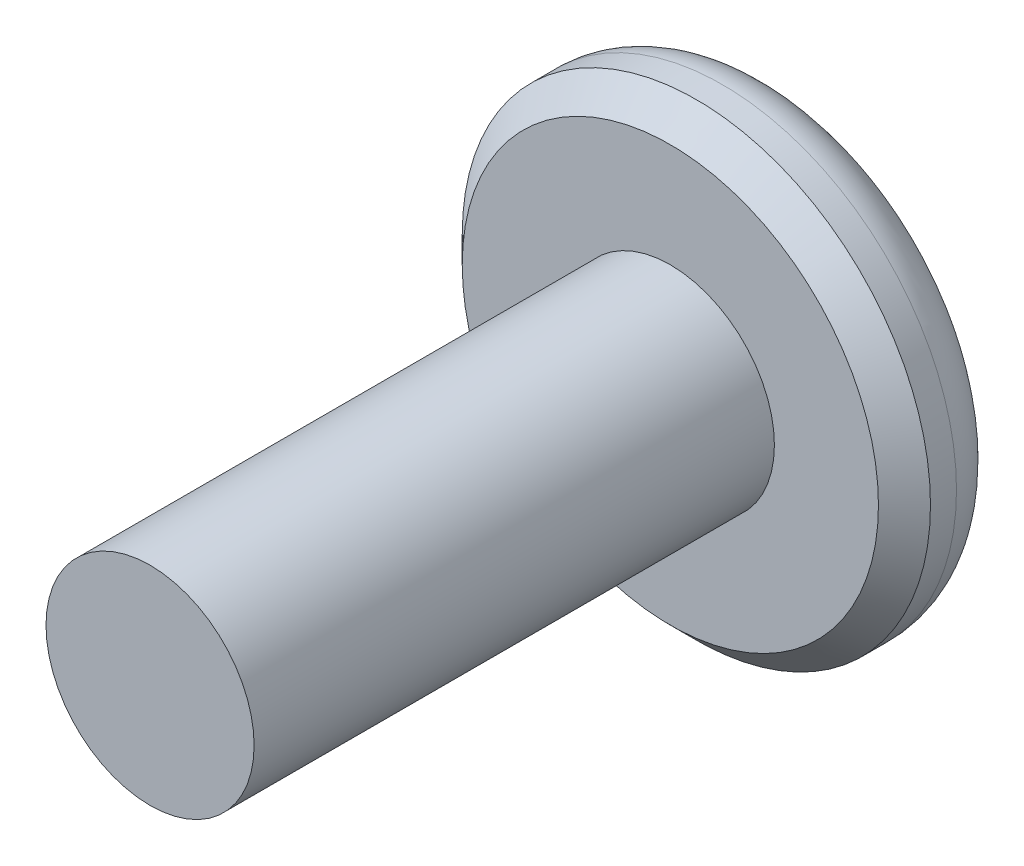
ISO-10303-21;
HEADER;
FILE_DESCRIPTION(('STEP AP214'),'2;1');
FILE_NAME('part.step','',(''),(''),'','','');
FILE_SCHEMA(('AUTOMOTIVE_DESIGN { 1 0 10303 214 1 1 1 1 }'));
ENDSEC;
DATA;
#1=APPLICATION_CONTEXT('core data for automotive mechanical design processes');
#2=APPLICATION_PROTOCOL_DEFINITION('international standard','automotive_design',2000,#1);
#3=PRODUCT_CONTEXT('',#1,'mechanical');
#4=PRODUCT('Part','Part','',(#3));
#5=PRODUCT_RELATED_PRODUCT_CATEGORY('part','',(#4));
#6=PRODUCT_DEFINITION_FORMATION('','',#4);
#7=PRODUCT_DEFINITION_CONTEXT('part definition',#1,'design');
#8=PRODUCT_DEFINITION('design','',#6,#7);
#9=PRODUCT_DEFINITION_SHAPE('','',#8);
#10=(LENGTH_UNIT() NAMED_UNIT(*) SI_UNIT(.MILLI.,.METRE.));
#11=(NAMED_UNIT(*) PLANE_ANGLE_UNIT() SI_UNIT($,.RADIAN.));
#12=(NAMED_UNIT(*) SI_UNIT($,.STERADIAN.) SOLID_ANGLE_UNIT());
#13=UNCERTAINTY_MEASURE_WITH_UNIT(LENGTH_MEASURE(1.E-05),#10,'distance_accuracy_value','');
#14=(GEOMETRIC_REPRESENTATION_CONTEXT(3) GLOBAL_UNCERTAINTY_ASSIGNED_CONTEXT((#13)) GLOBAL_UNIT_ASSIGNED_CONTEXT((#10,
#11,#12)) REPRESENTATION_CONTEXT('',''));
#15=CARTESIAN_POINT('',(0.,0.,0.));
#16=DIRECTION('',(0.,0.,1.));
#17=DIRECTION('',(1.,0.,0.));
#18=AXIS2_PLACEMENT_3D('',#15,#16,#17);
#19=CARTESIAN_POINT('',(0.,0.,2.));
#20=DIRECTION('',(0.,0.,-1.));
#21=DIRECTION('',(-1.,0.,0.));
#22=AXIS2_PLACEMENT_3D('',#19,#20,#21);
#23=CYLINDRICAL_SURFACE('',#22,4.5);
#24=CARTESIAN_POINT('',(0.,0.,1.5));
#25=DIRECTION('',(0.,0.,1.));
#26=DIRECTION('',(1.,0.,0.));
#27=AXIS2_PLACEMENT_3D('',#24,#25,#26);
#28=CIRCLE('',#27,4.5);
#29=CARTESIAN_POINT('',(4.5,0.,1.5));
#30=VERTEX_POINT('',#29);
#31=EDGE_CURVE('E11',#30,#30,#28,.F.);
#32=ORIENTED_EDGE('',*,*,#31,.T.);
#33=EDGE_LOOP('',(#32));
#34=FACE_BOUND('',#33,.T.);
#35=CARTESIAN_POINT('',(0.,0.,1.));
#36=DIRECTION('',(0.,0.,1.));
#37=DIRECTION('',(1.,0.,0.));
#38=AXIS2_PLACEMENT_3D('',#35,#36,#37);
#39=CIRCLE('',#38,4.5);
#40=CARTESIAN_POINT('',(4.5,0.,1.));
#41=VERTEX_POINT('',#40);
#42=EDGE_CURVE('E151',#41,#41,#39,.T.);
#43=ORIENTED_EDGE('',*,*,#42,.T.);
#44=EDGE_LOOP('',(#43));
#45=FACE_BOUND('',#44,.T.);
#46=ADVANCED_FACE('F37',(#34,#45),#23,.T.);
#47=CARTESIAN_POINT('',(0.,0.,2.));
#48=DIRECTION('',(0.,0.,1.));
#49=DIRECTION('',(1.,0.,0.));
#50=AXIS2_PLACEMENT_3D('',#47,#48,#49);
#51=PLANE('',#50);
#52=CARTESIAN_POINT('',(0.,0.,2.));
#53=DIRECTION('',(0.,0.,1.));
#54=DIRECTION('',(1.,0.,0.));
#55=AXIS2_PLACEMENT_3D('',#52,#53,#54);
#56=CIRCLE('',#55,4.);
#57=CARTESIAN_POINT('',(4.,0.,2.));
#58=VERTEX_POINT('',#57);
#59=EDGE_CURVE('E46',#58,#58,#56,.T.);
#60=ORIENTED_EDGE('',*,*,#59,.T.);
#61=EDGE_LOOP('',(#60));
#62=FACE_BOUND('',#61,.T.);
#63=CARTESIAN_POINT('',(0.,0.,2.));
#64=DIRECTION('',(0.,0.,1.));
#65=DIRECTION('',(1.,0.,0.));
#66=AXIS2_PLACEMENT_3D('',#63,#64,#65);
#67=CIRCLE('',#66,2.);
#68=CARTESIAN_POINT('',(2.,0.,2.));
#69=VERTEX_POINT('',#68);
#70=EDGE_CURVE('E148',#69,#69,#67,.T.);
#71=ORIENTED_EDGE('',*,*,#70,.F.);
#72=EDGE_LOOP('',(#71));
#73=FACE_BOUND('',#72,.T.);
#74=ADVANCED_FACE('F159',(#62,#73),#51,.T.);
#75=CARTESIAN_POINT('',(0.,0.,0.));
#76=DIRECTION('',(0.,0.,1.));
#77=DIRECTION('',(1.,0.,0.));
#78=AXIS2_PLACEMENT_3D('',#75,#76,#77);
#79=PLANE('',#78);
#80=DIRECTION('',(0.5,-0.866025403784439,0.));
#81=VECTOR('',#80,1.);
#82=CARTESIAN_POINT('',(0.866025403784439,1.5,0.));
#83=LINE('',#82,#81);
#84=CARTESIAN_POINT('',(0.866025403784439,1.5,0.));
#85=VERTEX_POINT('',#84);
#86=CARTESIAN_POINT('',(1.73205080756888,0.,0.));
#87=VERTEX_POINT('',#86);
#88=EDGE_CURVE('E127',#85,#87,#83,.T.);
#89=ORIENTED_EDGE('',*,*,#88,.F.);
#90=DIRECTION('',(1.,0.,0.));
#91=VECTOR('',#90,1.);
#92=CARTESIAN_POINT('',(-0.866025403784438,1.5,0.));
#93=LINE('',#92,#91);
#94=CARTESIAN_POINT('',(-0.866025403784438,1.5,0.));
#95=VERTEX_POINT('',#94);
#96=EDGE_CURVE('E53',#95,#85,#93,.T.);
#97=ORIENTED_EDGE('',*,*,#96,.F.);
#98=DIRECTION('',(0.5,0.866025403784438,0.));
#99=VECTOR('',#98,1.);
#100=CARTESIAN_POINT('',(-1.73205080756888,0.,0.));
#101=LINE('',#100,#99);
#102=CARTESIAN_POINT('',(-1.73205080756888,0.,0.));
#103=VERTEX_POINT('',#102);
#104=EDGE_CURVE('E136',#103,#95,#101,.T.);
#105=ORIENTED_EDGE('',*,*,#104,.F.);
#106=DIRECTION('',(-0.5,0.866025403784439,0.));
#107=VECTOR('',#106,1.);
#108=CARTESIAN_POINT('',(-0.866025403784437,-1.5,0.));
#109=LINE('',#108,#107);
#110=CARTESIAN_POINT('',(-0.866025403784437,-1.5,0.));
#111=VERTEX_POINT('',#110);
#112=EDGE_CURVE('E134',#111,#103,#109,.T.);
#113=ORIENTED_EDGE('',*,*,#112,.F.);
#114=DIRECTION('',(-1.,0.,0.));
#115=VECTOR('',#114,1.);
#116=CARTESIAN_POINT('',(0.866025403784438,-1.5,0.));
#117=LINE('',#116,#115);
#118=CARTESIAN_POINT('',(0.866025403784438,-1.5,0.));
#119=VERTEX_POINT('',#118);
#120=EDGE_CURVE('E101',#119,#111,#117,.T.);
#121=ORIENTED_EDGE('',*,*,#120,.F.);
#122=DIRECTION('',(-0.5,-0.866025403784439,0.));
#123=VECTOR('',#122,1.);
#124=CARTESIAN_POINT('',(1.73205080756888,0.,0.));
#125=LINE('',#124,#123);
#126=EDGE_CURVE('E130',#87,#119,#125,.T.);
#127=ORIENTED_EDGE('',*,*,#126,.F.);
#128=EDGE_LOOP('',(#89,#97,#105,#113,#121,#127));
#129=FACE_BOUND('',#128,.T.);
#130=CARTESIAN_POINT('',(0.,0.,0.));
#131=DIRECTION('',(0.,0.,1.));
#132=DIRECTION('',(1.,0.,0.));
#133=AXIS2_PLACEMENT_3D('',#130,#131,#132);
#134=CIRCLE('',#133,3.5);
#135=CARTESIAN_POINT('',(3.5,0.,0.));
#136=VERTEX_POINT('',#135);
#137=EDGE_CURVE('E154',#136,#136,#134,.F.);
#138=ORIENTED_EDGE('',*,*,#137,.T.);
#139=EDGE_LOOP('',(#138));
#140=FACE_BOUND('',#139,.T.);
#141=ADVANCED_FACE('F181',(#129,#140),#79,.F.);
#142=CARTESIAN_POINT('',(0.,0.,12.));
#143=DIRECTION('',(0.,0.,-1.));
#144=DIRECTION('',(-1.,0.,0.));
#145=AXIS2_PLACEMENT_3D('',#142,#143,#144);
#146=CYLINDRICAL_SURFACE('',#145,2.);
#147=CARTESIAN_POINT('',(0.,0.,12.));
#148=DIRECTION('',(0.,0.,1.));
#149=DIRECTION('',(1.,0.,0.));
#150=AXIS2_PLACEMENT_3D('',#147,#148,#149);
#151=CIRCLE('',#150,2.);
#152=CARTESIAN_POINT('',(2.,0.,12.));
#153=VERTEX_POINT('',#152);
#154=EDGE_CURVE('E140',#153,#153,#151,.T.);
#155=ORIENTED_EDGE('',*,*,#154,.F.);
#156=EDGE_LOOP('',(#155));
#157=FACE_BOUND('',#156,.T.);
#158=ORIENTED_EDGE('',*,*,#70,.T.);
#159=EDGE_LOOP('',(#158));
#160=FACE_BOUND('',#159,.T.);
#161=ADVANCED_FACE('F186',(#157,#160),#146,.T.);
#162=CARTESIAN_POINT('',(0.,0.,12.));
#163=DIRECTION('',(0.,0.,1.));
#164=DIRECTION('',(1.,0.,0.));
#165=AXIS2_PLACEMENT_3D('',#162,#163,#164);
#166=PLANE('',#165);
#167=ORIENTED_EDGE('',*,*,#154,.T.);
#168=EDGE_LOOP('',(#167));
#169=FACE_BOUND('',#168,.T.);
#170=ADVANCED_FACE('F172',(#169),#166,.T.);
#171=CARTESIAN_POINT('',(0.,0.,1.));
#172=DIRECTION('',(0.,0.,1.));
#173=DIRECTION('',(1.,0.,0.));
#174=AXIS2_PLACEMENT_3D('',#171,#172,#173);
#175=TOROIDAL_SURFACE('',#174,3.5,1.);
#176=ORIENTED_EDGE('',*,*,#137,.F.);
#177=EDGE_LOOP('',(#176));
#178=FACE_BOUND('',#177,.T.);
#179=ORIENTED_EDGE('',*,*,#42,.F.);
#180=EDGE_LOOP('',(#179));
#181=FACE_BOUND('',#180,.T.);
#182=ADVANCED_FACE('F164',(#178,#181),#175,.T.);
#183=CARTESIAN_POINT('',(0.,0.,2.));
#184=DIRECTION('',(0.,0.,-1.));
#185=DIRECTION('',(-1.,0.,0.));
#186=AXIS2_PLACEMENT_3D('',#183,#184,#185);
#187=CONICAL_SURFACE('',#186,4.,0.785398163397447);
#188=ORIENTED_EDGE('',*,*,#31,.F.);
#189=EDGE_LOOP('',(#188));
#190=FACE_BOUND('',#189,.T.);
#191=ORIENTED_EDGE('',*,*,#59,.F.);
#192=EDGE_LOOP('',(#191));
#193=FACE_BOUND('',#192,.T.);
#194=ADVANCED_FACE('F40',(#190,#193),#187,.T.);
#195=CARTESIAN_POINT('',(-0.866025403784438,1.5,1.));
#196=DIRECTION('',(0.,1.,0.));
#197=DIRECTION('',(0.,0.,1.));
#198=AXIS2_PLACEMENT_3D('',#195,#196,#197);
#199=PLANE('',#198);
#200=ORIENTED_EDGE('',*,*,#96,.T.);
#201=DIRECTION('',(0.,0.,-1.));
#202=VECTOR('',#201,1.);
#203=CARTESIAN_POINT('',(0.866025403784439,1.5,1.));
#204=LINE('',#203,#202);
#205=CARTESIAN_POINT('',(0.866025403784439,1.5,1.));
#206=VERTEX_POINT('',#205);
#207=EDGE_CURVE('E83',#206,#85,#204,.T.);
#208=ORIENTED_EDGE('',*,*,#207,.F.);
#209=DIRECTION('',(1.,0.,0.));
#210=VECTOR('',#209,1.);
#211=CARTESIAN_POINT('',(-0.866025403784438,1.5,1.));
#212=LINE('',#211,#210);
#213=CARTESIAN_POINT('',(-0.866025403784438,1.5,1.));
#214=VERTEX_POINT('',#213);
#215=EDGE_CURVE('E138',#214,#206,#212,.T.);
#216=ORIENTED_EDGE('',*,*,#215,.F.);
#217=DIRECTION('',(0.,0.,-1.));
#218=VECTOR('',#217,1.);
#219=CARTESIAN_POINT('',(-0.866025403784438,1.5,1.));
#220=LINE('',#219,#218);
#221=EDGE_CURVE('E61',#214,#95,#220,.T.);
#222=ORIENTED_EDGE('',*,*,#221,.T.);
#223=EDGE_LOOP('',(#200,#208,#216,#222));
#224=FACE_BOUND('',#223,.T.);
#225=ADVANCED_FACE('F163',(#224),#199,.F.);
#226=CARTESIAN_POINT('',(-1.73205080756888,0.,1.));
#227=DIRECTION('',(-0.866025403784439,0.5,0.));
#228=DIRECTION('',(-0.5,-0.866025403784439,0.));
#229=AXIS2_PLACEMENT_3D('',#226,#227,#228);
#230=PLANE('',#229);
#231=ORIENTED_EDGE('',*,*,#104,.T.);
#232=ORIENTED_EDGE('',*,*,#221,.F.);
#233=DIRECTION('',(0.5,0.866025403784438,0.));
#234=VECTOR('',#233,1.);
#235=CARTESIAN_POINT('',(-1.73205080756888,0.,1.));
#236=LINE('',#235,#234);
#237=CARTESIAN_POINT('',(-1.73205080756888,0.,1.));
#238=VERTEX_POINT('',#237);
#239=EDGE_CURVE('E113',#238,#214,#236,.T.);
#240=ORIENTED_EDGE('',*,*,#239,.F.);
#241=DIRECTION('',(0.,0.,-1.));
#242=VECTOR('',#241,1.);
#243=CARTESIAN_POINT('',(-1.73205080756888,0.,1.));
#244=LINE('',#243,#242);
#245=EDGE_CURVE('E105',#238,#103,#244,.T.);
#246=ORIENTED_EDGE('',*,*,#245,.T.);
#247=EDGE_LOOP('',(#231,#232,#240,#246));
#248=FACE_BOUND('',#247,.T.);
#249=ADVANCED_FACE('F170',(#248),#230,.F.);
#250=CARTESIAN_POINT('',(-0.866025403784437,-1.5,1.));
#251=DIRECTION('',(-0.866025403784439,-0.5,0.));
#252=DIRECTION('',(0.5,-0.866025403784439,0.));
#253=AXIS2_PLACEMENT_3D('',#250,#251,#252);
#254=PLANE('',#253);
#255=ORIENTED_EDGE('',*,*,#112,.T.);
#256=ORIENTED_EDGE('',*,*,#245,.F.);
#257=DIRECTION('',(-0.5,0.866025403784439,0.));
#258=VECTOR('',#257,1.);
#259=CARTESIAN_POINT('',(-0.866025403784437,-1.5,1.));
#260=LINE('',#259,#258);
#261=CARTESIAN_POINT('',(-0.866025403784437,-1.5,1.));
#262=VERTEX_POINT('',#261);
#263=EDGE_CURVE('E109',#262,#238,#260,.T.);
#264=ORIENTED_EDGE('',*,*,#263,.F.);
#265=DIRECTION('',(0.,0.,-1.));
#266=VECTOR('',#265,1.);
#267=CARTESIAN_POINT('',(-0.866025403784437,-1.5,1.));
#268=LINE('',#267,#266);
#269=EDGE_CURVE('E94',#262,#111,#268,.T.);
#270=ORIENTED_EDGE('',*,*,#269,.T.);
#271=EDGE_LOOP('',(#255,#256,#264,#270));
#272=FACE_BOUND('',#271,.T.);
#273=ADVANCED_FACE('F110',(#272),#254,.F.);
#274=CARTESIAN_POINT('',(0.866025403784438,-1.5,1.));
#275=DIRECTION('',(0.,-1.,0.));
#276=DIRECTION('',(0.,0.,-1.));
#277=AXIS2_PLACEMENT_3D('',#274,#275,#276);
#278=PLANE('',#277);
#279=ORIENTED_EDGE('',*,*,#120,.T.);
#280=ORIENTED_EDGE('',*,*,#269,.F.);
#281=DIRECTION('',(-1.,0.,0.));
#282=VECTOR('',#281,1.);
#283=CARTESIAN_POINT('',(0.866025403784438,-1.5,1.));
#284=LINE('',#283,#282);
#285=CARTESIAN_POINT('',(0.866025403784438,-1.5,1.));
#286=VERTEX_POINT('',#285);
#287=EDGE_CURVE('E98',#286,#262,#284,.T.);
#288=ORIENTED_EDGE('',*,*,#287,.F.);
#289=DIRECTION('',(0.,0.,-1.));
#290=VECTOR('',#289,1.);
#291=CARTESIAN_POINT('',(0.866025403784438,-1.5,1.));
#292=LINE('',#291,#290);
#293=EDGE_CURVE('E106',#286,#119,#292,.T.);
#294=ORIENTED_EDGE('',*,*,#293,.T.);
#295=EDGE_LOOP('',(#279,#280,#288,#294));
#296=FACE_BOUND('',#295,.T.);
#297=ADVANCED_FACE('F96',(#296),#278,.F.);
#298=CARTESIAN_POINT('',(1.73205080756888,0.,1.));
#299=DIRECTION('',(0.866025403784439,-0.5,0.));
#300=DIRECTION('',(0.5,0.866025403784439,0.));
#301=AXIS2_PLACEMENT_3D('',#298,#299,#300);
#302=PLANE('',#301);
#303=ORIENTED_EDGE('',*,*,#126,.T.);
#304=ORIENTED_EDGE('',*,*,#293,.F.);
#305=DIRECTION('',(-0.5,-0.866025403784439,0.));
#306=VECTOR('',#305,1.);
#307=CARTESIAN_POINT('',(1.73205080756888,0.,1.));
#308=LINE('',#307,#306);
#309=CARTESIAN_POINT('',(1.73205080756888,0.,1.));
#310=VERTEX_POINT('',#309);
#311=EDGE_CURVE('E119',#310,#286,#308,.T.);
#312=ORIENTED_EDGE('',*,*,#311,.F.);
#313=DIRECTION('',(0.,0.,-1.));
#314=VECTOR('',#313,1.);
#315=CARTESIAN_POINT('',(1.73205080756888,0.,1.));
#316=LINE('',#315,#314);
#317=EDGE_CURVE('E143',#310,#87,#316,.T.);
#318=ORIENTED_EDGE('',*,*,#317,.T.);
#319=EDGE_LOOP('',(#303,#304,#312,#318));
#320=FACE_BOUND('',#319,.T.);
#321=ADVANCED_FACE('F198',(#320),#302,.F.);
#322=CARTESIAN_POINT('',(0.866025403784439,1.5,1.));
#323=DIRECTION('',(0.866025403784439,0.5,0.));
#324=DIRECTION('',(-0.5,0.866025403784439,0.));
#325=AXIS2_PLACEMENT_3D('',#322,#323,#324);
#326=PLANE('',#325);
#327=ORIENTED_EDGE('',*,*,#88,.T.);
#328=ORIENTED_EDGE('',*,*,#317,.F.);
#329=DIRECTION('',(0.5,-0.866025403784439,0.));
#330=VECTOR('',#329,1.);
#331=CARTESIAN_POINT('',(0.866025403784439,1.5,1.));
#332=LINE('',#331,#330);
#333=EDGE_CURVE('E121',#206,#310,#332,.T.);
#334=ORIENTED_EDGE('',*,*,#333,.F.);
#335=ORIENTED_EDGE('',*,*,#207,.T.);
#336=EDGE_LOOP('',(#327,#328,#334,#335));
#337=FACE_BOUND('',#336,.T.);
#338=ADVANCED_FACE('F195',(#337),#326,.F.);
#339=CARTESIAN_POINT('',(0.,0.,1.));
#340=DIRECTION('',(0.,0.,-1.));
#341=DIRECTION('',(-1.,0.,0.));
#342=AXIS2_PLACEMENT_3D('',#339,#340,#341);
#343=PLANE('',#342);
#344=ORIENTED_EDGE('',*,*,#215,.T.);
#345=ORIENTED_EDGE('',*,*,#333,.T.);
#346=ORIENTED_EDGE('',*,*,#311,.T.);
#347=ORIENTED_EDGE('',*,*,#287,.T.);
#348=ORIENTED_EDGE('',*,*,#263,.T.);
#349=ORIENTED_EDGE('',*,*,#239,.T.);
#350=EDGE_LOOP('',(#344,#345,#346,#347,#348,#349));
#351=FACE_BOUND('',#350,.T.);
#352=ADVANCED_FACE('F116',(#351),#343,.T.);
#353=CLOSED_SHELL('',(#46,#74,#141,#161,#170,#182,#194,#225,#249,#273,#297,#321,#338,#352));
#354=MANIFOLD_SOLID_BREP('B2',#353);
#355=ADVANCED_BREP_SHAPE_REPRESENTATION('',(#18,#354),#14);
#356=SHAPE_DEFINITION_REPRESENTATION(#9,#355);
ENDSEC;
END-ISO-10303-21;
